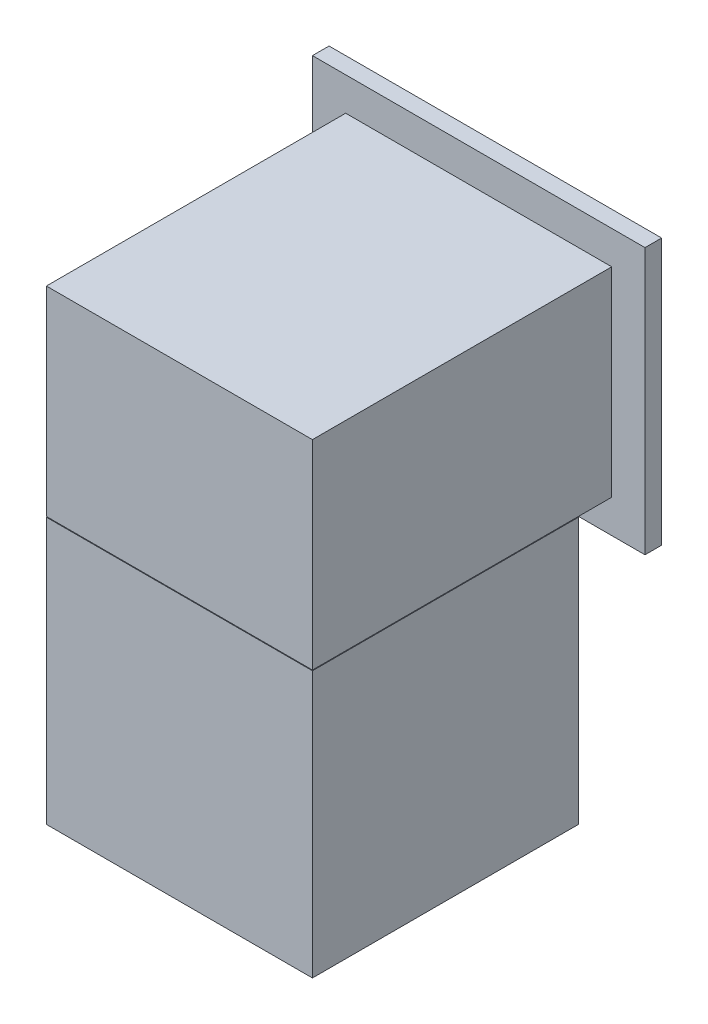
ISO-10303-21;
HEADER;
FILE_DESCRIPTION(('STEP AP214'),'2;1');
FILE_NAME('part.step','',(''),(''),'','','');
FILE_SCHEMA(('AUTOMOTIVE_DESIGN { 1 0 10303 214 1 1 1 1 }'));
ENDSEC;
DATA;
#1=APPLICATION_CONTEXT('core data for automotive mechanical design processes');
#2=APPLICATION_PROTOCOL_DEFINITION('international standard','automotive_design',2000,#1);
#3=PRODUCT_CONTEXT('',#1,'mechanical');
#4=PRODUCT('Part','Part','',(#3));
#5=PRODUCT_RELATED_PRODUCT_CATEGORY('part','',(#4));
#6=PRODUCT_DEFINITION_FORMATION('','',#4);
#7=PRODUCT_DEFINITION_CONTEXT('part definition',#1,'design');
#8=PRODUCT_DEFINITION('design','',#6,#7);
#9=PRODUCT_DEFINITION_SHAPE('','',#8);
#10=(LENGTH_UNIT() NAMED_UNIT(*) SI_UNIT(.MILLI.,.METRE.));
#11=(NAMED_UNIT(*) PLANE_ANGLE_UNIT() SI_UNIT($,.RADIAN.));
#12=(NAMED_UNIT(*) SI_UNIT($,.STERADIAN.) SOLID_ANGLE_UNIT());
#13=UNCERTAINTY_MEASURE_WITH_UNIT(LENGTH_MEASURE(1.E-05),#10,'distance_accuracy_value','');
#14=(GEOMETRIC_REPRESENTATION_CONTEXT(3) GLOBAL_UNCERTAINTY_ASSIGNED_CONTEXT((#13)) GLOBAL_UNIT_ASSIGNED_CONTEXT((#10,
#11,#12)) REPRESENTATION_CONTEXT('',''));
#15=CARTESIAN_POINT('',(0.,0.,0.));
#16=DIRECTION('',(0.,0.,1.));
#17=DIRECTION('',(1.,0.,0.));
#18=AXIS2_PLACEMENT_3D('',#15,#16,#17);
#19=CARTESIAN_POINT('',(1000.,-2.00000000000002,100.));
#20=DIRECTION('',(0.,0.,1.));
#21=DIRECTION('',(0.,-1.,0.));
#22=AXIS2_PLACEMENT_3D('',#19,#20,#21);
#23=PLANE('',#22);
#24=DIRECTION('',(-1.,0.,0.));
#25=VECTOR('',#24,1.);
#26=CARTESIAN_POINT('',(1000.,-802.,100.));
#27=LINE('',#26,#25);
#28=CARTESIAN_POINT('',(900.,-802.,100.));
#29=VERTEX_POINT('',#28);
#30=CARTESIAN_POINT('',(100.,-802.,100.));
#31=VERTEX_POINT('',#30);
#32=EDGE_CURVE('E93',#29,#31,#27,.T.);
#33=ORIENTED_EDGE('',*,*,#32,.T.);
#34=DIRECTION('',(0.,1.,0.));
#35=VECTOR('',#34,1.);
#36=CARTESIAN_POINT('',(100.,-2.00000000000002,100.));
#37=LINE('',#36,#35);
#38=CARTESIAN_POINT('',(100.,-2.00000000000002,100.));
#39=VERTEX_POINT('',#38);
#40=EDGE_CURVE('E67',#31,#39,#37,.T.);
#41=ORIENTED_EDGE('',*,*,#40,.T.);
#42=DIRECTION('',(-1.,0.,0.));
#43=VECTOR('',#42,1.);
#44=CARTESIAN_POINT('',(1000.,-2.00000000000002,100.));
#45=LINE('',#44,#43);
#46=CARTESIAN_POINT('',(900.,-2.00000000000002,100.));
#47=VERTEX_POINT('',#46);
#48=EDGE_CURVE('E89',#47,#39,#45,.T.);
#49=ORIENTED_EDGE('',*,*,#48,.F.);
#50=DIRECTION('',(0.,-1.,0.));
#51=VECTOR('',#50,1.);
#52=CARTESIAN_POINT('',(900.,-2.00000000000002,100.));
#53=LINE('',#52,#51);
#54=EDGE_CURVE('E83',#47,#29,#53,.T.);
#55=ORIENTED_EDGE('',*,*,#54,.T.);
#56=EDGE_LOOP('',(#33,#41,#49,#55));
#57=FACE_BOUND('',#56,.T.);
#58=ADVANCED_FACE('F45',(#57),#23,.F.);
#59=CARTESIAN_POINT('',(1000.,-2.00000000000002,100.));
#60=DIRECTION('',(0.,-1.,0.));
#61=DIRECTION('',(0.,0.,-1.));
#62=AXIS2_PLACEMENT_3D('',#59,#60,#61);
#63=PLANE('',#62);
#64=ORIENTED_EDGE('',*,*,#48,.T.);
#65=DIRECTION('',(0.,0.,1.));
#66=VECTOR('',#65,1.);
#67=CARTESIAN_POINT('',(100.,-2.00000000000002,100.));
#68=LINE('',#67,#66);
#69=CARTESIAN_POINT('',(100.,-2.00000000000011,900.));
#70=VERTEX_POINT('',#69);
#71=EDGE_CURVE('E103',#39,#70,#68,.T.);
#72=ORIENTED_EDGE('',*,*,#71,.T.);
#73=DIRECTION('',(-1.,0.,0.));
#74=VECTOR('',#73,1.);
#75=CARTESIAN_POINT('',(1000.,-2.00000000000011,900.));
#76=LINE('',#75,#74);
#77=CARTESIAN_POINT('',(900.,-2.00000000000011,900.));
#78=VERTEX_POINT('',#77);
#79=EDGE_CURVE('E101',#78,#70,#76,.T.);
#80=ORIENTED_EDGE('',*,*,#79,.F.);
#81=DIRECTION('',(0.,0.,-1.));
#82=VECTOR('',#81,1.);
#83=CARTESIAN_POINT('',(900.,-2.00000000000002,100.));
#84=LINE('',#83,#82);
#85=EDGE_CURVE('E96',#78,#47,#84,.T.);
#86=ORIENTED_EDGE('',*,*,#85,.T.);
#87=EDGE_LOOP('',(#64,#72,#80,#86));
#88=FACE_BOUND('',#87,.T.);
#89=ADVANCED_FACE('F111',(#88),#63,.F.);
#90=CARTESIAN_POINT('',(1000.,-2.00000000000011,900.));
#91=DIRECTION('',(0.,0.,-1.));
#92=DIRECTION('',(-1.,0.,0.));
#93=AXIS2_PLACEMENT_3D('',#90,#91,#92);
#94=PLANE('',#93);
#95=ORIENTED_EDGE('',*,*,#79,.T.);
#96=DIRECTION('',(0.,-1.,0.));
#97=VECTOR('',#96,1.);
#98=CARTESIAN_POINT('',(100.,-2.00000000000011,900.));
#99=LINE('',#98,#97);
#100=CARTESIAN_POINT('',(100.,-802.,900.));
#101=VERTEX_POINT('',#100);
#102=EDGE_CURVE('E95',#70,#101,#99,.T.);
#103=ORIENTED_EDGE('',*,*,#102,.T.);
#104=DIRECTION('',(-1.,0.,0.));
#105=VECTOR('',#104,1.);
#106=CARTESIAN_POINT('',(1000.,-802.,900.));
#107=LINE('',#106,#105);
#108=CARTESIAN_POINT('',(900.,-802.,900.));
#109=VERTEX_POINT('',#108);
#110=EDGE_CURVE('E99',#109,#101,#107,.T.);
#111=ORIENTED_EDGE('',*,*,#110,.F.);
#112=DIRECTION('',(0.,1.,0.));
#113=VECTOR('',#112,1.);
#114=CARTESIAN_POINT('',(900.,-2.00000000000011,900.));
#115=LINE('',#114,#113);
#116=EDGE_CURVE('E59',#109,#78,#115,.T.);
#117=ORIENTED_EDGE('',*,*,#116,.T.);
#118=EDGE_LOOP('',(#95,#103,#111,#117));
#119=FACE_BOUND('',#118,.T.);
#120=ADVANCED_FACE('F118',(#119),#94,.F.);
#121=CARTESIAN_POINT('',(1000.,-802.,100.));
#122=DIRECTION('',(0.,1.,0.));
#123=DIRECTION('',(0.,0.,1.));
#124=AXIS2_PLACEMENT_3D('',#121,#122,#123);
#125=PLANE('',#124);
#126=ORIENTED_EDGE('',*,*,#110,.T.);
#127=DIRECTION('',(0.,0.,-1.));
#128=VECTOR('',#127,1.);
#129=CARTESIAN_POINT('',(100.,-802.,100.));
#130=LINE('',#129,#128);
#131=EDGE_CURVE('E12',#101,#31,#130,.T.);
#132=ORIENTED_EDGE('',*,*,#131,.T.);
#133=ORIENTED_EDGE('',*,*,#32,.F.);
#134=DIRECTION('',(0.,0.,1.));
#135=VECTOR('',#134,1.);
#136=CARTESIAN_POINT('',(900.,-802.,100.));
#137=LINE('',#136,#135);
#138=EDGE_CURVE('E52',#29,#109,#137,.T.);
#139=ORIENTED_EDGE('',*,*,#138,.T.);
#140=EDGE_LOOP('',(#126,#132,#133,#139));
#141=FACE_BOUND('',#140,.T.);
#142=ADVANCED_FACE('F98',(#141),#125,.F.);
#143=CARTESIAN_POINT('',(900.,-1589.,5.5735940369142E-13));
#144=DIRECTION('',(-1.,0.,0.));
#145=DIRECTION('',(0.,0.,1.));
#146=AXIS2_PLACEMENT_3D('',#143,#144,#145);
#147=PLANE('',#146);
#148=ORIENTED_EDGE('',*,*,#85,.F.);
#149=ORIENTED_EDGE('',*,*,#116,.F.);
#150=ORIENTED_EDGE('',*,*,#138,.F.);
#151=ORIENTED_EDGE('',*,*,#54,.F.);
#152=EDGE_LOOP('',(#148,#149,#150,#151));
#153=FACE_BOUND('',#152,.T.);
#154=ADVANCED_FACE('F82',(#153),#147,.F.);
#155=CARTESIAN_POINT('',(100.,-1589.,5.05311914727658E-13));
#156=DIRECTION('',(1.,0.,0.));
#157=DIRECTION('',(0.,0.,-1.));
#158=AXIS2_PLACEMENT_3D('',#155,#156,#157);
#159=PLANE('',#158);
#160=ORIENTED_EDGE('',*,*,#131,.F.);
#161=ORIENTED_EDGE('',*,*,#102,.F.);
#162=ORIENTED_EDGE('',*,*,#71,.F.);
#163=ORIENTED_EDGE('',*,*,#40,.F.);
#164=EDGE_LOOP('',(#160,#161,#162,#163));
#165=FACE_BOUND('',#164,.T.);
#166=ADVANCED_FACE('F119',(#165),#159,.F.);
#167=CLOSED_SHELL('',(#58,#89,#120,#142,#154,#166));
#168=MANIFOLD_SOLID_BREP('B2',#167);
#169=CARTESIAN_POINT('',(1000.,-99.9999999999999,0.));
#170=DIRECTION('',(0.,1.,0.));
#171=DIRECTION('',(0.,0.,1.));
#172=AXIS2_PLACEMENT_3D('',#169,#170,#171);
#173=PLANE('',#172);
#174=DIRECTION('',(0.,0.,-1.));
#175=VECTOR('',#174,1.);
#176=CARTESIAN_POINT('',(0.,-99.9999999999999,0.));
#177=LINE('',#176,#175);
#178=CARTESIAN_POINT('',(0.,-99.9999999999999,0.));
#179=VERTEX_POINT('',#178);
#180=CARTESIAN_POINT('',(0.,-99.9999999999999,-50.));
#181=VERTEX_POINT('',#180);
#182=EDGE_CURVE('E537',#179,#181,#177,.T.);
#183=ORIENTED_EDGE('',*,*,#182,.T.);
#184=DIRECTION('',(-1.,0.,0.));
#185=VECTOR('',#184,1.);
#186=CARTESIAN_POINT('',(1000.,-99.9999999999999,-50.));
#187=LINE('',#186,#185);
#188=CARTESIAN_POINT('',(1000.,-99.9999999999999,-50.));
#189=VERTEX_POINT('',#188);
#190=EDGE_CURVE('E574',#189,#181,#187,.T.);
#191=ORIENTED_EDGE('',*,*,#190,.F.);
#192=DIRECTION('',(0.,0.,-1.));
#193=VECTOR('',#192,1.);
#194=CARTESIAN_POINT('',(1000.,-99.9999999999999,0.));
#195=LINE('',#194,#193);
#196=CARTESIAN_POINT('',(1000.,-99.9999999999999,0.));
#197=VERTEX_POINT('',#196);
#198=EDGE_CURVE('E541',#197,#189,#195,.T.);
#199=ORIENTED_EDGE('',*,*,#198,.F.);
#200=DIRECTION('',(-1.,0.,0.));
#201=VECTOR('',#200,1.);
#202=CARTESIAN_POINT('',(1000.,-99.9999999999999,0.));
#203=LINE('',#202,#201);
#204=EDGE_CURVE('E577',#197,#179,#203,.T.);
#205=ORIENTED_EDGE('',*,*,#204,.T.);
#206=EDGE_LOOP('',(#183,#191,#199,#205));
#207=FACE_BOUND('',#206,.T.);
#208=ADVANCED_FACE('F168',(#207),#173,.F.);
#209=CARTESIAN_POINT('',(1000.,700.,-49.9999999999999));
#210=DIRECTION('',(0.,0.,1.));
#211=DIRECTION('',(0.,-1.,0.));
#212=AXIS2_PLACEMENT_3D('',#209,#210,#211);
#213=PLANE('',#212);
#214=DIRECTION('',(-1.,0.,0.));
#215=VECTOR('',#214,1.);
#216=CARTESIAN_POINT('',(900.,0.,-50.));
#217=LINE('',#216,#215);
#218=CARTESIAN_POINT('',(900.,0.,-50.));
#219=VERTEX_POINT('',#218);
#220=CARTESIAN_POINT('',(100.,1.0321604682062E-13,-50.));
#221=VERTEX_POINT('',#220);
#222=EDGE_CURVE('E506',#219,#221,#217,.T.);
#223=ORIENTED_EDGE('',*,*,#222,.F.);
#224=DIRECTION('',(0.,-1.,0.));
#225=VECTOR('',#224,1.);
#226=CARTESIAN_POINT('',(900.,600.,-49.9999999999999));
#227=LINE('',#226,#225);
#228=CARTESIAN_POINT('',(900.,600.,-49.9999999999999));
#229=VERTEX_POINT('',#228);
#230=EDGE_CURVE('E472',#229,#219,#227,.T.);
#231=ORIENTED_EDGE('',*,*,#230,.F.);
#232=DIRECTION('',(1.,0.,0.));
#233=VECTOR('',#232,1.);
#234=CARTESIAN_POINT('',(900.,600.,-49.9999999999999));
#235=LINE('',#234,#233);
#236=CARTESIAN_POINT('',(100.,600.,-49.9999999999999));
#237=VERTEX_POINT('',#236);
#238=EDGE_CURVE('E495',#237,#229,#235,.T.);
#239=ORIENTED_EDGE('',*,*,#238,.F.);
#240=DIRECTION('',(0.,1.,0.));
#241=VECTOR('',#240,1.);
#242=CARTESIAN_POINT('',(100.,600.,-49.9999999999999));
#243=LINE('',#242,#241);
#244=EDGE_CURVE('E509',#221,#237,#243,.T.);
#245=ORIENTED_EDGE('',*,*,#244,.F.);
#246=EDGE_LOOP('',(#223,#231,#239,#245));
#247=FACE_BOUND('',#246,.T.);
#248=DIRECTION('',(0.,1.,0.));
#249=VECTOR('',#248,1.);
#250=CARTESIAN_POINT('',(0.,700.,-49.9999999999999));
#251=LINE('',#250,#249);
#252=CARTESIAN_POINT('',(0.,700.,-49.9999999999999));
#253=VERTEX_POINT('',#252);
#254=EDGE_CURVE('E551',#181,#253,#251,.T.);
#255=ORIENTED_EDGE('',*,*,#254,.T.);
#256=DIRECTION('',(-1.,0.,0.));
#257=VECTOR('',#256,1.);
#258=CARTESIAN_POINT('',(1000.,700.,-49.9999999999999));
#259=LINE('',#258,#257);
#260=CARTESIAN_POINT('',(1000.,700.,-49.9999999999999));
#261=VERTEX_POINT('',#260);
#262=EDGE_CURVE('E571',#261,#253,#259,.T.);
#263=ORIENTED_EDGE('',*,*,#262,.F.);
#264=DIRECTION('',(0.,1.,0.));
#265=VECTOR('',#264,1.);
#266=CARTESIAN_POINT('',(1000.,700.,-49.9999999999999));
#267=LINE('',#266,#265);
#268=EDGE_CURVE('E544',#189,#261,#267,.T.);
#269=ORIENTED_EDGE('',*,*,#268,.F.);
#270=ORIENTED_EDGE('',*,*,#190,.T.);
#271=EDGE_LOOP('',(#255,#263,#269,#270));
#272=FACE_BOUND('',#271,.T.);
#273=ADVANCED_FACE('F612',(#247,#272),#213,.F.);
#274=CARTESIAN_POINT('',(1000.,700.,0.));
#275=DIRECTION('',(0.,-1.,0.));
#276=DIRECTION('',(0.,0.,-1.));
#277=AXIS2_PLACEMENT_3D('',#274,#275,#276);
#278=PLANE('',#277);
#279=DIRECTION('',(0.,0.,1.));
#280=VECTOR('',#279,1.);
#281=CARTESIAN_POINT('',(0.,700.,0.));
#282=LINE('',#281,#280);
#283=CARTESIAN_POINT('',(0.,700.,0.));
#284=VERTEX_POINT('',#283);
#285=EDGE_CURVE('E553',#253,#284,#282,.T.);
#286=ORIENTED_EDGE('',*,*,#285,.T.);
#287=DIRECTION('',(-1.,0.,0.));
#288=VECTOR('',#287,1.);
#289=CARTESIAN_POINT('',(1000.,700.,0.));
#290=LINE('',#289,#288);
#291=CARTESIAN_POINT('',(1000.,700.,0.));
#292=VERTEX_POINT('',#291);
#293=EDGE_CURVE('E568',#292,#284,#290,.T.);
#294=ORIENTED_EDGE('',*,*,#293,.F.);
#295=DIRECTION('',(0.,0.,1.));
#296=VECTOR('',#295,1.);
#297=CARTESIAN_POINT('',(1000.,700.,0.));
#298=LINE('',#297,#296);
#299=EDGE_CURVE('E546',#261,#292,#298,.T.);
#300=ORIENTED_EDGE('',*,*,#299,.F.);
#301=ORIENTED_EDGE('',*,*,#262,.T.);
#302=EDGE_LOOP('',(#286,#294,#300,#301));
#303=FACE_BOUND('',#302,.T.);
#304=ADVANCED_FACE('F619',(#303),#278,.F.);
#305=CARTESIAN_POINT('',(1000.,600.,0.));
#306=DIRECTION('',(0.,0.,-1.));
#307=DIRECTION('',(0.,1.,0.));
#308=AXIS2_PLACEMENT_3D('',#305,#306,#307);
#309=PLANE('',#308);
#310=DIRECTION('',(0.,-1.,0.));
#311=VECTOR('',#310,1.);
#312=CARTESIAN_POINT('',(0.,600.,0.));
#313=LINE('',#312,#311);
#314=EDGE_CURVE('E542',#284,#179,#313,.T.);
#315=ORIENTED_EDGE('',*,*,#314,.T.);
#316=ORIENTED_EDGE('',*,*,#204,.F.);
#317=DIRECTION('',(0.,-1.,0.));
#318=VECTOR('',#317,1.);
#319=CARTESIAN_POINT('',(1000.,0.,0.));
#320=LINE('',#319,#318);
#321=EDGE_CURVE('E538',#292,#197,#320,.T.);
#322=ORIENTED_EDGE('',*,*,#321,.F.);
#323=ORIENTED_EDGE('',*,*,#293,.T.);
#324=EDGE_LOOP('',(#315,#316,#322,#323));
#325=FACE_BOUND('',#324,.T.);
#326=DIRECTION('',(-1.,0.,0.));
#327=VECTOR('',#326,1.);
#328=CARTESIAN_POINT('',(1000.,0.,0.));
#329=LINE('',#328,#327);
#330=CARTESIAN_POINT('',(900.,0.,1.65327317884893E-13));
#331=VERTEX_POINT('',#330);
#332=CARTESIAN_POINT('',(100.,0.,1.1327982892113E-13));
#333=VERTEX_POINT('',#332);
#334=EDGE_CURVE('E549',#331,#333,#329,.T.);
#335=ORIENTED_EDGE('',*,*,#334,.T.);
#336=DIRECTION('',(0.,1.,0.));
#337=VECTOR('',#336,1.);
#338=CARTESIAN_POINT('',(100.,-1589.,5.05311914727658E-13));
#339=LINE('',#338,#337);
#340=CARTESIAN_POINT('',(100.,600.,0.));
#341=VERTEX_POINT('',#340);
#342=EDGE_CURVE('E526',#333,#341,#339,.T.);
#343=ORIENTED_EDGE('',*,*,#342,.T.);
#344=DIRECTION('',(-1.,0.,0.));
#345=VECTOR('',#344,1.);
#346=CARTESIAN_POINT('',(1000.,600.,0.));
#347=LINE('',#346,#345);
#348=CARTESIAN_POINT('',(900.,600.,0.));
#349=VERTEX_POINT('',#348);
#350=EDGE_CURVE('E565',#349,#341,#347,.T.);
#351=ORIENTED_EDGE('',*,*,#350,.F.);
#352=DIRECTION('',(0.,1.,0.));
#353=VECTOR('',#352,1.);
#354=CARTESIAN_POINT('',(900.,-1589.,5.5735940369142E-13));
#355=LINE('',#354,#353);
#356=EDGE_CURVE('E527',#331,#349,#355,.T.);
#357=ORIENTED_EDGE('',*,*,#356,.F.);
#358=EDGE_LOOP('',(#335,#343,#351,#357));
#359=FACE_BOUND('',#358,.T.);
#360=ADVANCED_FACE('F596',(#325,#359),#309,.F.);
#361=CARTESIAN_POINT('',(1000.,600.,0.));
#362=DIRECTION('',(0.,-1.,0.));
#363=DIRECTION('',(0.,0.,-1.));
#364=AXIS2_PLACEMENT_3D('',#361,#362,#363);
#365=PLANE('',#364);
#366=ORIENTED_EDGE('',*,*,#350,.T.);
#367=DIRECTION('',(0.,0.,-1.));
#368=VECTOR('',#367,1.);
#369=CARTESIAN_POINT('',(100.,600.,0.));
#370=LINE('',#369,#368);
#371=CARTESIAN_POINT('',(100.,600.,900.));
#372=VERTEX_POINT('',#371);
#373=EDGE_CURVE('E523',#372,#341,#370,.T.);
#374=ORIENTED_EDGE('',*,*,#373,.F.);
#375=DIRECTION('',(-1.,0.,0.));
#376=VECTOR('',#375,1.);
#377=CARTESIAN_POINT('',(1000.,600.,900.));
#378=LINE('',#377,#376);
#379=CARTESIAN_POINT('',(900.,600.,900.));
#380=VERTEX_POINT('',#379);
#381=EDGE_CURVE('E562',#380,#372,#378,.T.);
#382=ORIENTED_EDGE('',*,*,#381,.F.);
#383=DIRECTION('',(0.,0.,1.));
#384=VECTOR('',#383,1.);
#385=CARTESIAN_POINT('',(900.,600.,0.));
#386=LINE('',#385,#384);
#387=EDGE_CURVE('E516',#349,#380,#386,.T.);
#388=ORIENTED_EDGE('',*,*,#387,.F.);
#389=EDGE_LOOP('',(#366,#374,#382,#388));
#390=FACE_BOUND('',#389,.T.);
#391=ADVANCED_FACE('F592',(#390),#365,.F.);
#392=CARTESIAN_POINT('',(1000.,-1.10218211923262E-13,900.));
#393=DIRECTION('',(0.,0.,-1.));
#394=DIRECTION('',(0.,1.,0.));
#395=AXIS2_PLACEMENT_3D('',#392,#393,#394);
#396=PLANE('',#395);
#397=ORIENTED_EDGE('',*,*,#381,.T.);
#398=DIRECTION('',(0.,-1.,0.));
#399=VECTOR('',#398,1.);
#400=CARTESIAN_POINT('',(100.,-1.10218211923262E-13,900.));
#401=LINE('',#400,#399);
#402=CARTESIAN_POINT('',(100.,-1.10218211923262E-13,900.));
#403=VERTEX_POINT('',#402);
#404=EDGE_CURVE('E534',#372,#403,#401,.T.);
#405=ORIENTED_EDGE('',*,*,#404,.T.);
#406=DIRECTION('',(-1.,0.,0.));
#407=VECTOR('',#406,1.);
#408=CARTESIAN_POINT('',(1000.,-1.10218211923262E-13,900.));
#409=LINE('',#408,#407);
#410=CARTESIAN_POINT('',(900.,-1.10218211923262E-13,900.));
#411=VERTEX_POINT('',#410);
#412=EDGE_CURVE('E559',#411,#403,#409,.T.);
#413=ORIENTED_EDGE('',*,*,#412,.F.);
#414=DIRECTION('',(0.,1.,0.));
#415=VECTOR('',#414,1.);
#416=CARTESIAN_POINT('',(900.,-1.10218211923262E-13,900.));
#417=LINE('',#416,#415);
#418=EDGE_CURVE('E529',#411,#380,#417,.T.);
#419=ORIENTED_EDGE('',*,*,#418,.T.);
#420=EDGE_LOOP('',(#397,#405,#413,#419));
#421=FACE_BOUND('',#420,.T.);
#422=ADVANCED_FACE('F586',(#421),#396,.F.);
#423=CARTESIAN_POINT('',(1000.,0.,0.));
#424=DIRECTION('',(0.,1.,0.));
#425=DIRECTION('',(0.,0.,1.));
#426=AXIS2_PLACEMENT_3D('',#423,#424,#425);
#427=PLANE('',#426);
#428=ORIENTED_EDGE('',*,*,#412,.T.);
#429=DIRECTION('',(0.,0.,-1.));
#430=VECTOR('',#429,1.);
#431=CARTESIAN_POINT('',(100.,0.,0.));
#432=LINE('',#431,#430);
#433=EDGE_CURVE('E43',#403,#333,#432,.T.);
#434=ORIENTED_EDGE('',*,*,#433,.T.);
#435=ORIENTED_EDGE('',*,*,#334,.F.);
#436=DIRECTION('',(0.,0.,1.));
#437=VECTOR('',#436,1.);
#438=CARTESIAN_POINT('',(900.,0.,0.));
#439=LINE('',#438,#437);
#440=EDGE_CURVE('E175',#331,#411,#439,.T.);
#441=ORIENTED_EDGE('',*,*,#440,.T.);
#442=EDGE_LOOP('',(#428,#434,#435,#441));
#443=FACE_BOUND('',#442,.T.);
#444=ADVANCED_FACE('F582',(#443),#427,.F.);
#445=CARTESIAN_POINT('',(1000.,0.,0.));
#446=DIRECTION('',(1.,0.,0.));
#447=DIRECTION('',(0.,0.,-1.));
#448=AXIS2_PLACEMENT_3D('',#445,#446,#447);
#449=PLANE('',#448);
#450=ORIENTED_EDGE('',*,*,#299,.T.);
#451=ORIENTED_EDGE('',*,*,#321,.T.);
#452=ORIENTED_EDGE('',*,*,#198,.T.);
#453=ORIENTED_EDGE('',*,*,#268,.T.);
#454=EDGE_LOOP('',(#450,#451,#452,#453));
#455=FACE_BOUND('',#454,.T.);
#456=ADVANCED_FACE('F636',(#455),#449,.T.);
#457=CARTESIAN_POINT('',(0.,0.,0.));
#458=DIRECTION('',(1.,0.,0.));
#459=DIRECTION('',(0.,0.,-1.));
#460=AXIS2_PLACEMENT_3D('',#457,#458,#459);
#461=PLANE('',#460);
#462=ORIENTED_EDGE('',*,*,#182,.F.);
#463=ORIENTED_EDGE('',*,*,#314,.F.);
#464=ORIENTED_EDGE('',*,*,#285,.F.);
#465=ORIENTED_EDGE('',*,*,#254,.F.);
#466=EDGE_LOOP('',(#462,#463,#464,#465));
#467=FACE_BOUND('',#466,.T.);
#468=ADVANCED_FACE('F608',(#467),#461,.F.);
#469=CARTESIAN_POINT('',(100.,-1589.,5.05311914727658E-13));
#470=DIRECTION('',(1.,0.,0.));
#471=DIRECTION('',(0.,0.,-1.));
#472=AXIS2_PLACEMENT_3D('',#469,#470,#471);
#473=PLANE('',#472);
#474=ORIENTED_EDGE('',*,*,#373,.T.);
#475=ORIENTED_EDGE('',*,*,#342,.F.);
#476=ORIENTED_EDGE('',*,*,#433,.F.);
#477=ORIENTED_EDGE('',*,*,#404,.F.);
#478=EDGE_LOOP('',(#474,#475,#476,#477));
#479=FACE_BOUND('',#478,.T.);
#480=ADVANCED_FACE('F590',(#479),#473,.F.);
#481=CARTESIAN_POINT('',(900.,-1589.,5.5735940369142E-13));
#482=DIRECTION('',(-1.,0.,0.));
#483=DIRECTION('',(0.,0.,1.));
#484=AXIS2_PLACEMENT_3D('',#481,#482,#483);
#485=PLANE('',#484);
#486=ORIENTED_EDGE('',*,*,#440,.F.);
#487=ORIENTED_EDGE('',*,*,#356,.T.);
#488=ORIENTED_EDGE('',*,*,#387,.T.);
#489=ORIENTED_EDGE('',*,*,#418,.F.);
#490=EDGE_LOOP('',(#486,#487,#488,#489));
#491=FACE_BOUND('',#490,.T.);
#492=ADVANCED_FACE('F597',(#491),#485,.F.);
#493=CARTESIAN_POINT('',(900.,600.,-39.9999999999999));
#494=DIRECTION('',(1.,0.,0.));
#495=DIRECTION('',(0.,1.,0.));
#496=AXIS2_PLACEMENT_3D('',#493,#494,#495);
#497=PLANE('',#496);
#498=ORIENTED_EDGE('',*,*,#230,.T.);
#499=DIRECTION('',(0.,0.,-1.));
#500=VECTOR('',#499,1.);
#501=CARTESIAN_POINT('',(900.,0.,-40.));
#502=LINE('',#501,#500);
#503=CARTESIAN_POINT('',(900.,0.,-40.));
#504=VERTEX_POINT('',#503);
#505=EDGE_CURVE('E504',#504,#219,#502,.T.);
#506=ORIENTED_EDGE('',*,*,#505,.F.);
#507=DIRECTION('',(0.,-1.,0.));
#508=VECTOR('',#507,1.);
#509=CARTESIAN_POINT('',(900.,600.,-39.9999999999999));
#510=LINE('',#509,#508);
#511=CARTESIAN_POINT('',(900.,600.,-39.9999999999999));
#512=VERTEX_POINT('',#511);
#513=EDGE_CURVE('E491',#512,#504,#510,.T.);
#514=ORIENTED_EDGE('',*,*,#513,.F.);
#515=DIRECTION('',(0.,0.,-1.));
#516=VECTOR('',#515,1.);
#517=CARTESIAN_POINT('',(900.,600.,-39.9999999999999));
#518=LINE('',#517,#516);
#519=EDGE_CURVE('E514',#512,#229,#518,.T.);
#520=ORIENTED_EDGE('',*,*,#519,.T.);
#521=EDGE_LOOP('',(#498,#506,#514,#520));
#522=FACE_BOUND('',#521,.T.);
#523=ADVANCED_FACE('F599',(#522),#497,.F.);
#524=CARTESIAN_POINT('',(900.,600.,-39.9999999999999));
#525=DIRECTION('',(0.,1.,0.));
#526=DIRECTION('',(-1.,0.,0.));
#527=AXIS2_PLACEMENT_3D('',#524,#525,#526);
#528=PLANE('',#527);
#529=ORIENTED_EDGE('',*,*,#238,.T.);
#530=ORIENTED_EDGE('',*,*,#519,.F.);
#531=DIRECTION('',(1.,0.,0.));
#532=VECTOR('',#531,1.);
#533=CARTESIAN_POINT('',(900.,600.,-39.9999999999999));
#534=LINE('',#533,#532);
#535=CARTESIAN_POINT('',(100.,600.,-39.9999999999999));
#536=VERTEX_POINT('',#535);
#537=EDGE_CURVE('E501',#536,#512,#534,.T.);
#538=ORIENTED_EDGE('',*,*,#537,.F.);
#539=DIRECTION('',(0.,0.,-1.));
#540=VECTOR('',#539,1.);
#541=CARTESIAN_POINT('',(100.,600.,-39.9999999999999));
#542=LINE('',#541,#540);
#543=EDGE_CURVE('E517',#536,#237,#542,.T.);
#544=ORIENTED_EDGE('',*,*,#543,.T.);
#545=EDGE_LOOP('',(#529,#530,#538,#544));
#546=FACE_BOUND('',#545,.T.);
#547=ADVANCED_FACE('F605',(#546),#528,.F.);
#548=CARTESIAN_POINT('',(100.,600.,-39.9999999999999));
#549=DIRECTION('',(-1.,0.,0.));
#550=DIRECTION('',(0.,0.,1.));
#551=AXIS2_PLACEMENT_3D('',#548,#549,#550);
#552=PLANE('',#551);
#553=ORIENTED_EDGE('',*,*,#244,.T.);
#554=ORIENTED_EDGE('',*,*,#543,.F.);
#555=DIRECTION('',(0.,1.,0.));
#556=VECTOR('',#555,1.);
#557=CARTESIAN_POINT('',(100.,600.,-39.9999999999999));
#558=LINE('',#557,#556);
#559=CARTESIAN_POINT('',(100.,1.02001740387436E-13,-40.));
#560=VERTEX_POINT('',#559);
#561=EDGE_CURVE('E498',#560,#536,#558,.T.);
#562=ORIENTED_EDGE('',*,*,#561,.F.);
#563=DIRECTION('',(0.,0.,-1.));
#564=VECTOR('',#563,1.);
#565=CARTESIAN_POINT('',(100.,1.02001740387436E-13,-40.));
#566=LINE('',#565,#564);
#567=EDGE_CURVE('E519',#560,#221,#566,.T.);
#568=ORIENTED_EDGE('',*,*,#567,.T.);
#569=EDGE_LOOP('',(#553,#554,#562,#568));
#570=FACE_BOUND('',#569,.T.);
#571=ADVANCED_FACE('F714',(#570),#552,.F.);
#572=CARTESIAN_POINT('',(900.,0.,-40.));
#573=DIRECTION('',(0.,-1.,0.));
#574=DIRECTION('',(1.,0.,0.));
#575=AXIS2_PLACEMENT_3D('',#572,#573,#574);
#576=PLANE('',#575);
#577=ORIENTED_EDGE('',*,*,#222,.T.);
#578=ORIENTED_EDGE('',*,*,#567,.F.);
#579=DIRECTION('',(-1.,0.,0.));
#580=VECTOR('',#579,1.);
#581=CARTESIAN_POINT('',(900.,0.,-40.));
#582=LINE('',#581,#580);
#583=EDGE_CURVE('E494',#504,#560,#582,.T.);
#584=ORIENTED_EDGE('',*,*,#583,.F.);
#585=ORIENTED_EDGE('',*,*,#505,.T.);
#586=EDGE_LOOP('',(#577,#578,#584,#585));
#587=FACE_BOUND('',#586,.T.);
#588=ADVANCED_FACE('F724',(#587),#576,.F.);
#589=CARTESIAN_POINT('',(0.,0.,-40.));
#590=DIRECTION('',(0.,0.,-1.));
#591=DIRECTION('',(0.,1.,0.));
#592=AXIS2_PLACEMENT_3D('',#589,#590,#591);
#593=PLANE('',#592);
#594=DIRECTION('',(0.,-1.,0.));
#595=VECTOR('',#594,1.);
#596=CARTESIAN_POINT('',(870.,570.,-39.9999999999999));
#597=LINE('',#596,#595);
#598=CARTESIAN_POINT('',(870.,570.,-39.9999999999999));
#599=VERTEX_POINT('',#598);
#600=CARTESIAN_POINT('',(870.,29.9999999999999,-40.));
#601=VERTEX_POINT('',#600);
#602=EDGE_CURVE('E452',#599,#601,#597,.T.);
#603=ORIENTED_EDGE('',*,*,#602,.F.);
#604=DIRECTION('',(1.,0.,0.));
#605=VECTOR('',#604,1.);
#606=CARTESIAN_POINT('',(870.,570.,-39.9999999999999));
#607=LINE('',#606,#605);
#608=CARTESIAN_POINT('',(280.,570.,-39.9999999999999));
#609=VERTEX_POINT('',#608);
#610=EDGE_CURVE('E466',#609,#599,#607,.T.);
#611=ORIENTED_EDGE('',*,*,#610,.F.);
#612=DIRECTION('',(0.,1.,0.));
#613=VECTOR('',#612,1.);
#614=CARTESIAN_POINT('',(280.,570.,-39.9999999999999));
#615=LINE('',#614,#613);
#616=CARTESIAN_POINT('',(280.,30.,-40.));
#617=VERTEX_POINT('',#616);
#618=EDGE_CURVE('E463',#617,#609,#615,.T.);
#619=ORIENTED_EDGE('',*,*,#618,.F.);
#620=DIRECTION('',(-1.,0.,0.));
#621=VECTOR('',#620,1.);
#622=CARTESIAN_POINT('',(870.,29.9999999999999,-40.));
#623=LINE('',#622,#621);
#624=EDGE_CURVE('E460',#601,#617,#623,.T.);
#625=ORIENTED_EDGE('',*,*,#624,.F.);
#626=EDGE_LOOP('',(#603,#611,#619,#625));
#627=FACE_BOUND('',#626,.T.);
#628=ORIENTED_EDGE('',*,*,#513,.T.);
#629=ORIENTED_EDGE('',*,*,#583,.T.);
#630=ORIENTED_EDGE('',*,*,#561,.T.);
#631=ORIENTED_EDGE('',*,*,#537,.T.);
#632=EDGE_LOOP('',(#628,#629,#630,#631));
#633=FACE_BOUND('',#632,.T.);
#634=ADVANCED_FACE('F734',(#627,#633),#593,.T.);
#635=CARTESIAN_POINT('',(870.,570.,-39.9999999999999));
#636=DIRECTION('',(0.965925826289068,0.,0.258819045102521));
#637=DIRECTION('',(0.258819045102521,0.,-0.965925826289068));
#638=AXIS2_PLACEMENT_3D('',#635,#636,#637);
#639=PLANE('',#638);
#640=ORIENTED_EDGE('',*,*,#602,.T.);
#641=DIRECTION('',(0.250562807085732,-0.250562807085732,-0.935113126531029));
#642=VECTOR('',#641,1.);
#643=CARTESIAN_POINT('',(836.097871040872,63.9021289591281,86.5244677602182));
#644=LINE('',#643,#642);
#645=CARTESIAN_POINT('',(816.410161513775,83.5898384862246,160.));
#646=VERTEX_POINT('',#645);
#647=EDGE_CURVE('E474',#646,#601,#644,.T.);
#648=ORIENTED_EDGE('',*,*,#647,.F.);
#649=DIRECTION('',(0.,-1.,0.));
#650=VECTOR('',#649,1.);
#651=CARTESIAN_POINT('',(816.410161513775,-1.87015926865653E-13,160.));
#652=LINE('',#651,#650);
#653=CARTESIAN_POINT('',(816.410161513775,516.410161513775,160.));
#654=VERTEX_POINT('',#653);
#655=EDGE_CURVE('E469',#654,#646,#652,.T.);
#656=ORIENTED_EDGE('',*,*,#655,.F.);
#657=DIRECTION('',(0.250562807085732,0.250562807085732,-0.935113126531029));
#658=VECTOR('',#657,1.);
#659=CARTESIAN_POINT('',(870.,570.,-39.9999999999999));
#660=LINE('',#659,#658);
#661=EDGE_CURVE('E470',#654,#599,#660,.T.);
#662=ORIENTED_EDGE('',*,*,#661,.T.);
#663=EDGE_LOOP('',(#640,#648,#656,#662));
#664=FACE_BOUND('',#663,.T.);
#665=ADVANCED_FACE('F744',(#664),#639,.F.);
#666=CARTESIAN_POINT('',(870.,570.,-39.9999999999999));
#667=DIRECTION('',(0.,0.965925826289068,0.258819045102521));
#668=DIRECTION('',(0.,-0.258819045102521,0.965925826289068));
#669=AXIS2_PLACEMENT_3D('',#666,#667,#668);
#670=PLANE('',#669);
#671=ORIENTED_EDGE('',*,*,#610,.T.);
#672=ORIENTED_EDGE('',*,*,#661,.F.);
#673=DIRECTION('',(1.,0.,0.));
#674=VECTOR('',#673,1.);
#675=CARTESIAN_POINT('',(0.,516.410161513775,160.));
#676=LINE('',#675,#674);
#677=CARTESIAN_POINT('',(333.589838486225,516.410161513775,160.));
#678=VERTEX_POINT('',#677);
#679=EDGE_CURVE('E478',#678,#654,#676,.T.);
#680=ORIENTED_EDGE('',*,*,#679,.F.);
#681=DIRECTION('',(-0.250562807085732,0.250562807085732,-0.935113126531029));
#682=VECTOR('',#681,1.);
#683=CARTESIAN_POINT('',(280.,570.,-39.9999999999999));
#684=LINE('',#683,#682);
#685=EDGE_CURVE('E473',#678,#609,#684,.T.);
#686=ORIENTED_EDGE('',*,*,#685,.T.);
#687=EDGE_LOOP('',(#671,#672,#680,#686));
#688=FACE_BOUND('',#687,.T.);
#689=ADVANCED_FACE('F754',(#688),#670,.F.);
#690=CARTESIAN_POINT('',(280.,570.,-39.9999999999999));
#691=DIRECTION('',(-0.965925826289068,0.,0.258819045102521));
#692=DIRECTION('',(0.258819045102521,0.,0.965925826289068));
#693=AXIS2_PLACEMENT_3D('',#690,#691,#692);
#694=PLANE('',#693);
#695=ORIENTED_EDGE('',*,*,#618,.T.);
#696=ORIENTED_EDGE('',*,*,#685,.F.);
#697=DIRECTION('',(0.,1.,0.));
#698=VECTOR('',#697,1.);
#699=CARTESIAN_POINT('',(333.589838486225,0.,160.));
#700=LINE('',#699,#698);
#701=CARTESIAN_POINT('',(333.589838486225,83.5898384862247,160.));
#702=VERTEX_POINT('',#701);
#703=EDGE_CURVE('E486',#702,#678,#700,.T.);
#704=ORIENTED_EDGE('',*,*,#703,.F.);
#705=DIRECTION('',(-0.250562807085732,-0.250562807085732,-0.935113126531029));
#706=VECTOR('',#705,1.);
#707=CARTESIAN_POINT('',(317.041214973862,67.0412149738623,98.2396962565347));
#708=LINE('',#707,#706);
#709=EDGE_CURVE('E477',#702,#617,#708,.T.);
#710=ORIENTED_EDGE('',*,*,#709,.T.);
#711=EDGE_LOOP('',(#695,#696,#704,#710));
#712=FACE_BOUND('',#711,.T.);
#713=ADVANCED_FACE('F765',(#712),#694,.F.);
#714=CARTESIAN_POINT('',(870.,29.9999999999999,-40.));
#715=DIRECTION('',(0.,-0.965925826289068,0.258819045102521));
#716=DIRECTION('',(0.,-0.258819045102521,-0.965925826289068));
#717=AXIS2_PLACEMENT_3D('',#714,#715,#716);
#718=PLANE('',#717);
#719=ORIENTED_EDGE('',*,*,#624,.T.);
#720=ORIENTED_EDGE('',*,*,#709,.F.);
#721=DIRECTION('',(-1.,0.,0.));
#722=VECTOR('',#721,1.);
#723=CARTESIAN_POINT('',(0.,83.5898384862247,160.));
#724=LINE('',#723,#722);
#725=EDGE_CURVE('E483',#646,#702,#724,.T.);
#726=ORIENTED_EDGE('',*,*,#725,.F.);
#727=ORIENTED_EDGE('',*,*,#647,.T.);
#728=EDGE_LOOP('',(#719,#720,#726,#727));
#729=FACE_BOUND('',#728,.T.);
#730=ADVANCED_FACE('F775',(#729),#718,.F.);
#731=CARTESIAN_POINT('',(0.,0.,160.));
#732=DIRECTION('',(0.,0.,-1.));
#733=DIRECTION('',(0.,1.,0.));
#734=AXIS2_PLACEMENT_3D('',#731,#732,#733);
#735=PLANE('',#734);
#736=DIRECTION('',(0.,-1.,0.));
#737=VECTOR('',#736,1.);
#738=CARTESIAN_POINT('',(563.589838486225,135.,160.));
#739=LINE('',#738,#737);
#740=CARTESIAN_POINT('',(563.589838486225,135.,160.));
#741=VERTEX_POINT('',#740);
#742=CARTESIAN_POINT('',(563.589838486225,95.,160.));
#743=VERTEX_POINT('',#742);
#744=EDGE_CURVE('E182',#741,#743,#739,.T.);
#745=ORIENTED_EDGE('',*,*,#744,.F.);
#746=DIRECTION('',(1.,0.,0.));
#747=VECTOR('',#746,1.);
#748=CARTESIAN_POINT('',(563.589838486225,135.,160.));
#749=LINE('',#748,#747);
#750=CARTESIAN_POINT('',(363.589838486225,135.,160.));
#751=VERTEX_POINT('',#750);
#752=EDGE_CURVE('E372',#751,#741,#749,.T.);
#753=ORIENTED_EDGE('',*,*,#752,.F.);
#754=DIRECTION('',(0.,1.,0.));
#755=VECTOR('',#754,1.);
#756=CARTESIAN_POINT('',(363.589838486225,135.,160.));
#757=LINE('',#756,#755);
#758=CARTESIAN_POINT('',(363.589838486225,95.,160.));
#759=VERTEX_POINT('',#758);
#760=EDGE_CURVE('E375',#759,#751,#757,.T.);
#761=ORIENTED_EDGE('',*,*,#760,.F.);
#762=DIRECTION('',(-1.,0.,0.));
#763=VECTOR('',#762,1.);
#764=CARTESIAN_POINT('',(563.589838486225,95.,160.));
#765=LINE('',#764,#763);
#766=EDGE_CURVE('E381',#743,#759,#765,.T.);
#767=ORIENTED_EDGE('',*,*,#766,.F.);
#768=EDGE_LOOP('',(#745,#753,#761,#767));
#769=FACE_BOUND('',#768,.T.);
#770=CARTESIAN_POINT('',(575.,496.410161513775,160.));
#771=DIRECTION('',(0.,0.,-1.));
#772=DIRECTION('',(0.,1.,0.));
#773=AXIS2_PLACEMENT_3D('',#770,#771,#772);
#774=CIRCLE('',#773,5.00000000000005);
#775=CARTESIAN_POINT('',(575.,501.410161513775,160.));
#776=VERTEX_POINT('',#775);
#777=EDGE_CURVE('E394',#776,#776,#774,.T.);
#778=ORIENTED_EDGE('',*,*,#777,.F.);
#779=EDGE_LOOP('',(#778));
#780=FACE_BOUND('',#779,.T.);
#781=DIRECTION('',(0.,-1.,0.));
#782=VECTOR('',#781,1.);
#783=CARTESIAN_POINT('',(783.589838486224,134.999999999998,160.));
#784=LINE('',#783,#782);
#785=CARTESIAN_POINT('',(783.589838486224,134.999999999998,160.));
#786=VERTEX_POINT('',#785);
#787=CARTESIAN_POINT('',(783.589838486224,94.9999999999984,160.));
#788=VERTEX_POINT('',#787);
#789=EDGE_CURVE('E190',#786,#788,#784,.T.);
#790=ORIENTED_EDGE('',*,*,#789,.F.);
#791=DIRECTION('',(1.,0.,0.));
#792=VECTOR('',#791,1.);
#793=CARTESIAN_POINT('',(783.589838486224,134.999999999998,160.));
#794=LINE('',#793,#792);
#795=CARTESIAN_POINT('',(583.589838486225,134.999999999998,160.));
#796=VERTEX_POINT('',#795);
#797=EDGE_CURVE('E402',#796,#786,#794,.T.);
#798=ORIENTED_EDGE('',*,*,#797,.F.);
#799=DIRECTION('',(0.,1.,0.));
#800=VECTOR('',#799,1.);
#801=CARTESIAN_POINT('',(583.589838486225,134.999999999998,160.));
#802=LINE('',#801,#800);
#803=CARTESIAN_POINT('',(583.589838486225,94.9999999999984,160.));
#804=VERTEX_POINT('',#803);
#805=EDGE_CURVE('E416',#804,#796,#802,.T.);
#806=ORIENTED_EDGE('',*,*,#805,.F.);
#807=DIRECTION('',(-1.,0.,0.));
#808=VECTOR('',#807,1.);
#809=CARTESIAN_POINT('',(783.589838486224,94.9999999999984,160.));
#810=LINE('',#809,#808);
#811=EDGE_CURVE('E413',#788,#804,#810,.T.);
#812=ORIENTED_EDGE('',*,*,#811,.F.);
#813=EDGE_LOOP('',(#790,#798,#806,#812));
#814=FACE_BOUND('',#813,.T.);
#815=DIRECTION('',(0.,1.,0.));
#816=VECTOR('',#815,1.);
#817=CARTESIAN_POINT('',(405.,476.410161513775,160.));
#818=LINE('',#817,#816);
#819=CARTESIAN_POINT('',(405.,206.410161513775,160.));
#820=VERTEX_POINT('',#819);
#821=CARTESIAN_POINT('',(405.,476.410161513775,160.));
#822=VERTEX_POINT('',#821);
#823=EDGE_CURVE('E388',#820,#822,#818,.T.);
#824=ORIENTED_EDGE('',*,*,#823,.F.);
#825=DIRECTION('',(-1.,0.,0.));
#826=VECTOR('',#825,1.);
#827=CARTESIAN_POINT('',(405.,206.410161513775,160.));
#828=LINE('',#827,#826);
#829=CARTESIAN_POINT('',(745.,206.410161513775,160.));
#830=VERTEX_POINT('',#829);
#831=EDGE_CURVE('E431',#830,#820,#828,.T.);
#832=ORIENTED_EDGE('',*,*,#831,.F.);
#833=DIRECTION('',(0.,-1.,0.));
#834=VECTOR('',#833,1.);
#835=CARTESIAN_POINT('',(745.,476.410161513775,160.));
#836=LINE('',#835,#834);
#837=CARTESIAN_POINT('',(745.,476.410161513775,160.));
#838=VERTEX_POINT('',#837);
#839=EDGE_CURVE('E445',#838,#830,#836,.T.);
#840=ORIENTED_EDGE('',*,*,#839,.F.);
#841=DIRECTION('',(1.,0.,0.));
#842=VECTOR('',#841,1.);
#843=CARTESIAN_POINT('',(405.,476.410161513775,160.));
#844=LINE('',#843,#842);
#845=EDGE_CURVE('E442',#822,#838,#844,.T.);
#846=ORIENTED_EDGE('',*,*,#845,.F.);
#847=EDGE_LOOP('',(#824,#832,#840,#846));
#848=FACE_BOUND('',#847,.T.);
#849=ORIENTED_EDGE('',*,*,#655,.T.);
#850=ORIENTED_EDGE('',*,*,#725,.T.);
#851=ORIENTED_EDGE('',*,*,#703,.T.);
#852=ORIENTED_EDGE('',*,*,#679,.T.);
#853=EDGE_LOOP('',(#849,#850,#851,#852));
#854=FACE_BOUND('',#853,.T.);
#855=ADVANCED_FACE('F785',(#769,#780,#814,#848,#854),#735,.T.);
#856=CARTESIAN_POINT('',(405.,476.410161513775,170.));
#857=DIRECTION('',(-1.,0.,0.));
#858=DIRECTION('',(0.,-1.,0.));
#859=AXIS2_PLACEMENT_3D('',#856,#857,#858);
#860=PLANE('',#859);
#861=ORIENTED_EDGE('',*,*,#823,.T.);
#862=DIRECTION('',(0.,0.,-1.));
#863=VECTOR('',#862,1.);
#864=CARTESIAN_POINT('',(405.,476.410161513775,170.));
#865=LINE('',#864,#863);
#866=CARTESIAN_POINT('',(405.,476.410161513775,170.));
#867=VERTEX_POINT('',#866);
#868=EDGE_CURVE('E440',#867,#822,#865,.T.);
#869=ORIENTED_EDGE('',*,*,#868,.F.);
#870=DIRECTION('',(0.,1.,0.));
#871=VECTOR('',#870,1.);
#872=CARTESIAN_POINT('',(405.,476.410161513775,170.));
#873=LINE('',#872,#871);
#874=CARTESIAN_POINT('',(405.,206.410161513775,170.));
#875=VERTEX_POINT('',#874);
#876=EDGE_CURVE('E427',#875,#867,#873,.T.);
#877=ORIENTED_EDGE('',*,*,#876,.F.);
#878=DIRECTION('',(0.,0.,-1.));
#879=VECTOR('',#878,1.);
#880=CARTESIAN_POINT('',(405.,206.410161513775,170.));
#881=LINE('',#880,#879);
#882=EDGE_CURVE('E450',#875,#820,#881,.T.);
#883=ORIENTED_EDGE('',*,*,#882,.T.);
#884=EDGE_LOOP('',(#861,#869,#877,#883));
#885=FACE_BOUND('',#884,.T.);
#886=ADVANCED_FACE('F796',(#885),#860,.F.);
#887=CARTESIAN_POINT('',(405.,206.410161513775,170.));
#888=DIRECTION('',(0.,-1.,0.));
#889=DIRECTION('',(0.,0.,-1.));
#890=AXIS2_PLACEMENT_3D('',#887,#888,#889);
#891=PLANE('',#890);
#892=ORIENTED_EDGE('',*,*,#831,.T.);
#893=ORIENTED_EDGE('',*,*,#882,.F.);
#894=DIRECTION('',(-1.,0.,0.));
#895=VECTOR('',#894,1.);
#896=CARTESIAN_POINT('',(405.,206.410161513775,170.));
#897=LINE('',#896,#895);
#898=CARTESIAN_POINT('',(745.,206.410161513775,170.));
#899=VERTEX_POINT('',#898);
#900=EDGE_CURVE('E437',#899,#875,#897,.T.);
#901=ORIENTED_EDGE('',*,*,#900,.F.);
#902=DIRECTION('',(0.,0.,-1.));
#903=VECTOR('',#902,1.);
#904=CARTESIAN_POINT('',(745.,206.410161513775,170.));
#905=LINE('',#904,#903);
#906=EDGE_CURVE('E453',#899,#830,#905,.T.);
#907=ORIENTED_EDGE('',*,*,#906,.T.);
#908=EDGE_LOOP('',(#892,#893,#901,#907));
#909=FACE_BOUND('',#908,.T.);
#910=ADVANCED_FACE('F805',(#909),#891,.F.);
#911=CARTESIAN_POINT('',(745.,476.410161513775,170.));
#912=DIRECTION('',(1.,0.,0.));
#913=DIRECTION('',(0.,0.,-1.));
#914=AXIS2_PLACEMENT_3D('',#911,#912,#913);
#915=PLANE('',#914);
#916=ORIENTED_EDGE('',*,*,#839,.T.);
#917=ORIENTED_EDGE('',*,*,#906,.F.);
#918=DIRECTION('',(0.,-1.,0.));
#919=VECTOR('',#918,1.);
#920=CARTESIAN_POINT('',(745.,476.410161513775,170.));
#921=LINE('',#920,#919);
#922=CARTESIAN_POINT('',(745.,476.410161513775,170.));
#923=VERTEX_POINT('',#922);
#924=EDGE_CURVE('E434',#923,#899,#921,.T.);
#925=ORIENTED_EDGE('',*,*,#924,.F.);
#926=DIRECTION('',(0.,0.,-1.));
#927=VECTOR('',#926,1.);
#928=CARTESIAN_POINT('',(745.,476.410161513775,170.));
#929=LINE('',#928,#927);
#930=EDGE_CURVE('E455',#923,#838,#929,.T.);
#931=ORIENTED_EDGE('',*,*,#930,.T.);
#932=EDGE_LOOP('',(#916,#917,#925,#931));
#933=FACE_BOUND('',#932,.T.);
#934=ADVANCED_FACE('F815',(#933),#915,.F.);
#935=CARTESIAN_POINT('',(405.,476.410161513775,170.));
#936=DIRECTION('',(0.,1.,0.));
#937=DIRECTION('',(0.,0.,1.));
#938=AXIS2_PLACEMENT_3D('',#935,#936,#937);
#939=PLANE('',#938);
#940=ORIENTED_EDGE('',*,*,#845,.T.);
#941=ORIENTED_EDGE('',*,*,#930,.F.);
#942=DIRECTION('',(1.,0.,0.));
#943=VECTOR('',#942,1.);
#944=CARTESIAN_POINT('',(405.,476.410161513775,170.));
#945=LINE('',#944,#943);
#946=EDGE_CURVE('E430',#867,#923,#945,.T.);
#947=ORIENTED_EDGE('',*,*,#946,.F.);
#948=ORIENTED_EDGE('',*,*,#868,.T.);
#949=EDGE_LOOP('',(#940,#941,#947,#948));
#950=FACE_BOUND('',#949,.T.);
#951=ADVANCED_FACE('F825',(#950),#939,.F.);
#952=CARTESIAN_POINT('',(0.,0.,170.));
#953=DIRECTION('',(0.,0.,1.));
#954=DIRECTION('',(0.,-1.,0.));
#955=AXIS2_PLACEMENT_3D('',#952,#953,#954);
#956=PLANE('',#955);
#957=ORIENTED_EDGE('',*,*,#876,.T.);
#958=ORIENTED_EDGE('',*,*,#946,.T.);
#959=ORIENTED_EDGE('',*,*,#924,.T.);
#960=ORIENTED_EDGE('',*,*,#900,.T.);
#961=EDGE_LOOP('',(#957,#958,#959,#960));
#962=FACE_BOUND('',#961,.T.);
#963=ADVANCED_FACE('F835',(#962),#956,.F.);
#964=CARTESIAN_POINT('',(783.589838486224,134.999999999998,170.));
#965=DIRECTION('',(1.,0.,0.));
#966=DIRECTION('',(0.,0.,-1.));
#967=AXIS2_PLACEMENT_3D('',#964,#965,#966);
#968=PLANE('',#967);
#969=ORIENTED_EDGE('',*,*,#789,.T.);
#970=DIRECTION('',(0.,0.,-1.));
#971=VECTOR('',#970,1.);
#972=CARTESIAN_POINT('',(783.589838486224,94.9999999999984,170.));
#973=LINE('',#972,#971);
#974=CARTESIAN_POINT('',(783.589838486224,94.9999999999984,170.));
#975=VERTEX_POINT('',#974);
#976=EDGE_CURVE('E411',#975,#788,#973,.T.);
#977=ORIENTED_EDGE('',*,*,#976,.F.);
#978=DIRECTION('',(0.,-1.,0.));
#979=VECTOR('',#978,1.);
#980=CARTESIAN_POINT('',(783.589838486224,134.999999999998,170.));
#981=LINE('',#980,#979);
#982=CARTESIAN_POINT('',(783.589838486224,134.999999999998,170.));
#983=VERTEX_POINT('',#982);
#984=EDGE_CURVE('E398',#983,#975,#981,.T.);
#985=ORIENTED_EDGE('',*,*,#984,.F.);
#986=DIRECTION('',(0.,0.,-1.));
#987=VECTOR('',#986,1.);
#988=CARTESIAN_POINT('',(783.589838486224,134.999999999998,170.));
#989=LINE('',#988,#987);
#990=EDGE_CURVE('E397',#983,#786,#989,.T.);
#991=ORIENTED_EDGE('',*,*,#990,.T.);
#992=EDGE_LOOP('',(#969,#977,#985,#991));
#993=FACE_BOUND('',#992,.T.);
#994=ADVANCED_FACE('F845',(#993),#968,.F.);
#995=CARTESIAN_POINT('',(783.589838486224,134.999999999998,170.));
#996=DIRECTION('',(0.,1.,0.));
#997=DIRECTION('',(0.,0.,1.));
#998=AXIS2_PLACEMENT_3D('',#995,#996,#997);
#999=PLANE('',#998);
#1000=ORIENTED_EDGE('',*,*,#797,.T.);
#1001=ORIENTED_EDGE('',*,*,#990,.F.);
#1002=DIRECTION('',(1.,0.,0.));
#1003=VECTOR('',#1002,1.);
#1004=CARTESIAN_POINT('',(783.589838486224,134.999999999998,170.));
#1005=LINE('',#1004,#1003);
#1006=CARTESIAN_POINT('',(583.589838486225,134.999999999998,170.));
#1007=VERTEX_POINT('',#1006);
#1008=EDGE_CURVE('E408',#1007,#983,#1005,.T.);
#1009=ORIENTED_EDGE('',*,*,#1008,.F.);
#1010=DIRECTION('',(0.,0.,-1.));
#1011=VECTOR('',#1010,1.);
#1012=CARTESIAN_POINT('',(583.589838486225,134.999999999998,170.));
#1013=LINE('',#1012,#1011);
#1014=EDGE_CURVE('E422',#1007,#796,#1013,.T.);
#1015=ORIENTED_EDGE('',*,*,#1014,.T.);
#1016=EDGE_LOOP('',(#1000,#1001,#1009,#1015));
#1017=FACE_BOUND('',#1016,.T.);
#1018=ADVANCED_FACE('F855',(#1017),#999,.F.);
#1019=CARTESIAN_POINT('',(583.589838486225,134.999999999998,170.));
#1020=DIRECTION('',(-1.,0.,0.));
#1021=DIRECTION('',(0.,0.,1.));
#1022=AXIS2_PLACEMENT_3D('',#1019,#1020,#1021);
#1023=PLANE('',#1022);
#1024=ORIENTED_EDGE('',*,*,#805,.T.);
#1025=ORIENTED_EDGE('',*,*,#1014,.F.);
#1026=DIRECTION('',(0.,1.,0.));
#1027=VECTOR('',#1026,1.);
#1028=CARTESIAN_POINT('',(583.589838486225,134.999999999998,170.));
#1029=LINE('',#1028,#1027);
#1030=CARTESIAN_POINT('',(583.589838486225,94.9999999999984,170.));
#1031=VERTEX_POINT('',#1030);
#1032=EDGE_CURVE('E405',#1031,#1007,#1029,.T.);
#1033=ORIENTED_EDGE('',*,*,#1032,.F.);
#1034=DIRECTION('',(0.,0.,-1.));
#1035=VECTOR('',#1034,1.);
#1036=CARTESIAN_POINT('',(583.589838486225,94.9999999999984,170.));
#1037=LINE('',#1036,#1035);
#1038=EDGE_CURVE('E424',#1031,#804,#1037,.T.);
#1039=ORIENTED_EDGE('',*,*,#1038,.T.);
#1040=EDGE_LOOP('',(#1024,#1025,#1033,#1039));
#1041=FACE_BOUND('',#1040,.T.);
#1042=ADVANCED_FACE('F864',(#1041),#1023,.F.);
#1043=CARTESIAN_POINT('',(783.589838486224,94.9999999999984,170.));
#1044=DIRECTION('',(0.,-1.,0.));
#1045=DIRECTION('',(0.,0.,-1.));
#1046=AXIS2_PLACEMENT_3D('',#1043,#1044,#1045);
#1047=PLANE('',#1046);
#1048=ORIENTED_EDGE('',*,*,#811,.T.);
#1049=ORIENTED_EDGE('',*,*,#1038,.F.);
#1050=DIRECTION('',(-1.,0.,0.));
#1051=VECTOR('',#1050,1.);
#1052=CARTESIAN_POINT('',(783.589838486224,94.9999999999984,170.));
#1053=LINE('',#1052,#1051);
#1054=EDGE_CURVE('E401',#975,#1031,#1053,.T.);
#1055=ORIENTED_EDGE('',*,*,#1054,.F.);
#1056=ORIENTED_EDGE('',*,*,#976,.T.);
#1057=EDGE_LOOP('',(#1048,#1049,#1055,#1056));
#1058=FACE_BOUND('',#1057,.T.);
#1059=ADVANCED_FACE('F874',(#1058),#1047,.F.);
#1060=CARTESIAN_POINT('',(0.,-1.12178784779833E-13,170.));
#1061=DIRECTION('',(0.,0.,-1.));
#1062=DIRECTION('',(0.,1.,0.));
#1063=AXIS2_PLACEMENT_3D('',#1060,#1061,#1062);
#1064=PLANE('',#1063);
#1065=ORIENTED_EDGE('',*,*,#984,.T.);
#1066=ORIENTED_EDGE('',*,*,#1054,.T.);
#1067=ORIENTED_EDGE('',*,*,#1032,.T.);
#1068=ORIENTED_EDGE('',*,*,#1008,.T.);
#1069=EDGE_LOOP('',(#1065,#1066,#1067,#1068));
#1070=FACE_BOUND('',#1069,.T.);
#1071=ADVANCED_FACE('F884',(#1070),#1064,.T.);
#1072=CARTESIAN_POINT('',(575.,496.410161513775,170.));
#1073=DIRECTION('',(0.,0.,-1.));
#1074=DIRECTION('',(0.,1.,0.));
#1075=AXIS2_PLACEMENT_3D('',#1072,#1073,#1074);
#1076=CYLINDRICAL_SURFACE('',#1075,5.00000000000005);
#1077=CARTESIAN_POINT('',(575.,496.410161513775,170.));
#1078=DIRECTION('',(0.,0.,-1.));
#1079=DIRECTION('',(0.,1.,0.));
#1080=AXIS2_PLACEMENT_3D('',#1077,#1078,#1079);
#1081=CIRCLE('',#1080,5.00000000000005);
#1082=CARTESIAN_POINT('',(575.,501.410161513775,170.));
#1083=VERTEX_POINT('',#1082);
#1084=EDGE_CURVE('E382',#1083,#1083,#1081,.T.);
#1085=ORIENTED_EDGE('',*,*,#1084,.F.);
#1086=EDGE_LOOP('',(#1085));
#1087=FACE_BOUND('',#1086,.T.);
#1088=ORIENTED_EDGE('',*,*,#777,.T.);
#1089=EDGE_LOOP('',(#1088));
#1090=FACE_BOUND('',#1089,.T.);
#1091=ADVANCED_FACE('F894',(#1087,#1090),#1076,.F.);
#1092=CARTESIAN_POINT('',(575.,496.410161513775,170.));
#1093=DIRECTION('',(0.,0.,-1.));
#1094=DIRECTION('',(0.,1.,0.));
#1095=AXIS2_PLACEMENT_3D('',#1092,#1093,#1094);
#1096=PLANE('',#1095);
#1097=ORIENTED_EDGE('',*,*,#1084,.T.);
#1098=EDGE_LOOP('',(#1097));
#1099=FACE_BOUND('',#1098,.T.);
#1100=ADVANCED_FACE('F904',(#1099),#1096,.T.);
#1101=CARTESIAN_POINT('',(563.589838486225,135.,170.));
#1102=DIRECTION('',(1.,0.,0.));
#1103=DIRECTION('',(0.,0.,-1.));
#1104=AXIS2_PLACEMENT_3D('',#1101,#1102,#1103);
#1105=PLANE('',#1104);
#1106=ORIENTED_EDGE('',*,*,#744,.T.);
#1107=DIRECTION('',(0.,0.,-1.));
#1108=VECTOR('',#1107,1.);
#1109=CARTESIAN_POINT('',(563.589838486225,95.,170.));
#1110=LINE('',#1109,#1108);
#1111=CARTESIAN_POINT('',(563.589838486225,95.,170.));
#1112=VERTEX_POINT('',#1111);
#1113=EDGE_CURVE('E350',#1112,#743,#1110,.T.);
#1114=ORIENTED_EDGE('',*,*,#1113,.F.);
#1115=DIRECTION('',(0.,-1.,0.));
#1116=VECTOR('',#1115,1.);
#1117=CARTESIAN_POINT('',(563.589838486225,135.,170.));
#1118=LINE('',#1117,#1116);
#1119=CARTESIAN_POINT('',(563.589838486225,135.,170.));
#1120=VERTEX_POINT('',#1119);
#1121=EDGE_CURVE('E354',#1120,#1112,#1118,.T.);
#1122=ORIENTED_EDGE('',*,*,#1121,.F.);
#1123=DIRECTION('',(0.,0.,-1.));
#1124=VECTOR('',#1123,1.);
#1125=CARTESIAN_POINT('',(563.589838486225,135.,170.));
#1126=LINE('',#1125,#1124);
#1127=EDGE_CURVE('E386',#1120,#741,#1126,.T.);
#1128=ORIENTED_EDGE('',*,*,#1127,.T.);
#1129=EDGE_LOOP('',(#1106,#1114,#1122,#1128));
#1130=FACE_BOUND('',#1129,.T.);
#1131=ADVANCED_FACE('F352',(#1130),#1105,.F.);
#1132=CARTESIAN_POINT('',(563.589838486225,135.,170.));
#1133=DIRECTION('',(0.,1.,0.));
#1134=DIRECTION('',(0.,0.,1.));
#1135=AXIS2_PLACEMENT_3D('',#1132,#1133,#1134);
#1136=PLANE('',#1135);
#1137=ORIENTED_EDGE('',*,*,#752,.T.);
#1138=ORIENTED_EDGE('',*,*,#1127,.F.);
#1139=DIRECTION('',(1.,0.,0.));
#1140=VECTOR('',#1139,1.);
#1141=CARTESIAN_POINT('',(563.589838486225,135.,170.));
#1142=LINE('',#1141,#1140);
#1143=CARTESIAN_POINT('',(363.589838486225,135.,170.));
#1144=VERTEX_POINT('',#1143);
#1145=EDGE_CURVE('E360',#1144,#1120,#1142,.T.);
#1146=ORIENTED_EDGE('',*,*,#1145,.F.);
#1147=DIRECTION('',(0.,0.,-1.));
#1148=VECTOR('',#1147,1.);
#1149=CARTESIAN_POINT('',(363.589838486225,135.,170.));
#1150=LINE('',#1149,#1148);
#1151=EDGE_CURVE('E389',#1144,#751,#1150,.T.);
#1152=ORIENTED_EDGE('',*,*,#1151,.T.);
#1153=EDGE_LOOP('',(#1137,#1138,#1146,#1152));
#1154=FACE_BOUND('',#1153,.T.);
#1155=ADVANCED_FACE('F923',(#1154),#1136,.F.);
#1156=CARTESIAN_POINT('',(363.589838486225,135.,170.));
#1157=DIRECTION('',(-1.,0.,0.));
#1158=DIRECTION('',(0.,0.,1.));
#1159=AXIS2_PLACEMENT_3D('',#1156,#1157,#1158);
#1160=PLANE('',#1159);
#1161=ORIENTED_EDGE('',*,*,#760,.T.);
#1162=ORIENTED_EDGE('',*,*,#1151,.F.);
#1163=DIRECTION('',(0.,1.,0.));
#1164=VECTOR('',#1163,1.);
#1165=CARTESIAN_POINT('',(363.589838486225,135.,170.));
#1166=LINE('',#1165,#1164);
#1167=CARTESIAN_POINT('',(363.589838486225,95.,170.));
#1168=VERTEX_POINT('',#1167);
#1169=EDGE_CURVE('E368',#1168,#1144,#1166,.T.);
#1170=ORIENTED_EDGE('',*,*,#1169,.F.);
#1171=DIRECTION('',(0.,0.,-1.));
#1172=VECTOR('',#1171,1.);
#1173=CARTESIAN_POINT('',(363.589838486225,95.,170.));
#1174=LINE('',#1173,#1172);
#1175=EDGE_CURVE('E359',#1168,#759,#1174,.T.);
#1176=ORIENTED_EDGE('',*,*,#1175,.T.);
#1177=EDGE_LOOP('',(#1161,#1162,#1170,#1176));
#1178=FACE_BOUND('',#1177,.T.);
#1179=ADVANCED_FACE('F932',(#1178),#1160,.F.);
#1180=CARTESIAN_POINT('',(563.589838486225,95.,170.));
#1181=DIRECTION('',(0.,-1.,0.));
#1182=DIRECTION('',(0.,0.,-1.));
#1183=AXIS2_PLACEMENT_3D('',#1180,#1181,#1182);
#1184=PLANE('',#1183);
#1185=ORIENTED_EDGE('',*,*,#766,.T.);
#1186=ORIENTED_EDGE('',*,*,#1175,.F.);
#1187=DIRECTION('',(-1.,0.,0.));
#1188=VECTOR('',#1187,1.);
#1189=CARTESIAN_POINT('',(563.589838486225,95.,170.));
#1190=LINE('',#1189,#1188);
#1191=EDGE_CURVE('E363',#1112,#1168,#1190,.T.);
#1192=ORIENTED_EDGE('',*,*,#1191,.F.);
#1193=ORIENTED_EDGE('',*,*,#1113,.T.);
#1194=EDGE_LOOP('',(#1185,#1186,#1192,#1193));
#1195=FACE_BOUND('',#1194,.T.);
#1196=ADVANCED_FACE('F364',(#1195),#1184,.F.);
#1197=CARTESIAN_POINT('',(0.,-1.12178784779833E-13,170.));
#1198=DIRECTION('',(0.,0.,-1.));
#1199=DIRECTION('',(0.,1.,0.));
#1200=AXIS2_PLACEMENT_3D('',#1197,#1198,#1199);
#1201=PLANE('',#1200);
#1202=ORIENTED_EDGE('',*,*,#1121,.T.);
#1203=ORIENTED_EDGE('',*,*,#1191,.T.);
#1204=ORIENTED_EDGE('',*,*,#1169,.T.);
#1205=ORIENTED_EDGE('',*,*,#1145,.T.);
#1206=EDGE_LOOP('',(#1202,#1203,#1204,#1205));
#1207=FACE_BOUND('',#1206,.T.);
#1208=ADVANCED_FACE('F370',(#1207),#1201,.T.);
#1209=CLOSED_SHELL('',(#208,#273,#304,#360,#391,#422,#444,#456,#468,#480,#492,#523,#547,#571,
#588,#634,#665,#689,#713,#730,#855,#886,#910,#934,#951,#963,#994,#1018,#1042,#1059,#1071,#1091,
#1100,#1131,#1155,#1179,#1196,#1208));
#1210=MANIFOLD_SOLID_BREP('B6',#1209);
#1211=ADVANCED_BREP_SHAPE_REPRESENTATION('',(#18,#168,#1210),#14);
#1212=SHAPE_DEFINITION_REPRESENTATION(#9,#1211);
ENDSEC;
END-ISO-10303-21;
